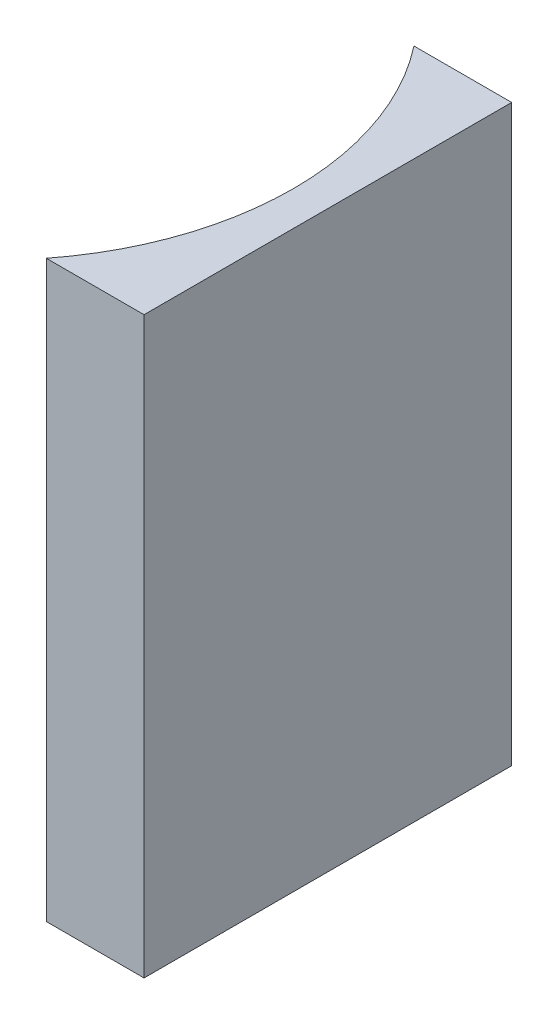
ISO-10303-21;
HEADER;
FILE_DESCRIPTION(('STEP AP214'),'2;1');
FILE_NAME('part.step','',(''),(''),'','','');
FILE_SCHEMA(('AUTOMOTIVE_DESIGN { 1 0 10303 214 1 1 1 1 }'));
ENDSEC;
DATA;
#1=APPLICATION_CONTEXT('core data for automotive mechanical design processes');
#2=APPLICATION_PROTOCOL_DEFINITION('international standard','automotive_design',2000,#1);
#3=PRODUCT_CONTEXT('',#1,'mechanical');
#4=PRODUCT('Part','Part','',(#3));
#5=PRODUCT_RELATED_PRODUCT_CATEGORY('part','',(#4));
#6=PRODUCT_DEFINITION_FORMATION('','',#4);
#7=PRODUCT_DEFINITION_CONTEXT('part definition',#1,'design');
#8=PRODUCT_DEFINITION('design','',#6,#7);
#9=PRODUCT_DEFINITION_SHAPE('','',#8);
#10=(LENGTH_UNIT() NAMED_UNIT(*) SI_UNIT(.MILLI.,.METRE.));
#11=(NAMED_UNIT(*) PLANE_ANGLE_UNIT() SI_UNIT($,.RADIAN.));
#12=(NAMED_UNIT(*) SI_UNIT($,.STERADIAN.) SOLID_ANGLE_UNIT());
#13=UNCERTAINTY_MEASURE_WITH_UNIT(LENGTH_MEASURE(1.E-05),#10,'distance_accuracy_value','');
#14=(GEOMETRIC_REPRESENTATION_CONTEXT(3) GLOBAL_UNCERTAINTY_ASSIGNED_CONTEXT((#13)) GLOBAL_UNIT_ASSIGNED_CONTEXT((#10,
#11,#12)) REPRESENTATION_CONTEXT('',''));
#15=CARTESIAN_POINT('',(0.,0.,0.));
#16=DIRECTION('',(0.,0.,1.));
#17=DIRECTION('',(1.,0.,0.));
#18=AXIS2_PLACEMENT_3D('',#15,#16,#17);
#19=CARTESIAN_POINT('',(0.,25.,0.));
#20=DIRECTION('',(0.,0.,1.));
#21=DIRECTION('',(1.,0.,0.));
#22=AXIS2_PLACEMENT_3D('',#19,#20,#21);
#23=PLANE('',#22);
#24=DIRECTION('',(-1.,0.,0.));
#25=VECTOR('',#24,1.);
#26=CARTESIAN_POINT('',(0.,0.,0.));
#27=LINE('',#26,#25);
#28=CARTESIAN_POINT('',(0.,0.,0.));
#29=VERTEX_POINT('',#28);
#30=CARTESIAN_POINT('',(-4.2530492340404,0.,0.));
#31=VERTEX_POINT('',#30);
#32=EDGE_CURVE('E100',#29,#31,#27,.T.);
#33=ORIENTED_EDGE('',*,*,#32,.T.);
#34=DIRECTION('',(0.,-1.,0.));
#35=VECTOR('',#34,1.);
#36=CARTESIAN_POINT('',(-4.2530492340404,25.,0.));
#37=LINE('',#36,#35);
#38=CARTESIAN_POINT('',(-4.2530492340404,25.,0.));
#39=VERTEX_POINT('',#38);
#40=EDGE_CURVE('E11',#39,#31,#37,.T.);
#41=ORIENTED_EDGE('',*,*,#40,.F.);
#42=DIRECTION('',(-1.,0.,0.));
#43=VECTOR('',#42,1.);
#44=CARTESIAN_POINT('',(0.,25.,0.));
#45=LINE('',#44,#43);
#46=CARTESIAN_POINT('',(0.,25.,0.));
#47=VERTEX_POINT('',#46);
#48=EDGE_CURVE('E88',#47,#39,#45,.T.);
#49=ORIENTED_EDGE('',*,*,#48,.F.);
#50=DIRECTION('',(0.,-1.,0.));
#51=VECTOR('',#50,1.);
#52=CARTESIAN_POINT('',(0.,25.,0.));
#53=LINE('',#52,#51);
#54=EDGE_CURVE('E96',#47,#29,#53,.T.);
#55=ORIENTED_EDGE('',*,*,#54,.T.);
#56=EDGE_LOOP('',(#33,#41,#49,#55));
#57=FACE_BOUND('',#56,.T.);
#58=ADVANCED_FACE('F37',(#57),#23,.F.);
#59=CARTESIAN_POINT('',(-14.5,25.,8.));
#60=DIRECTION('',(0.,-1.,0.));
#61=DIRECTION('',(0.,0.,-1.));
#62=AXIS2_PLACEMENT_3D('',#59,#60,#61);
#63=CYLINDRICAL_SURFACE('',#62,13.);
#64=CARTESIAN_POINT('',(-14.5,0.,8.));
#65=DIRECTION('',(0.,-1.,0.));
#66=DIRECTION('',(0.,0.,1.));
#67=AXIS2_PLACEMENT_3D('',#64,#65,#66);
#68=CIRCLE('',#67,13.);
#69=CARTESIAN_POINT('',(-4.2530492340404,0.,16.));
#70=VERTEX_POINT('',#69);
#71=EDGE_CURVE('E92',#31,#70,#68,.T.);
#72=ORIENTED_EDGE('',*,*,#71,.T.);
#73=DIRECTION('',(0.,-1.,0.));
#74=VECTOR('',#73,1.);
#75=CARTESIAN_POINT('',(-4.2530492340404,25.,16.));
#76=LINE('',#75,#74);
#77=CARTESIAN_POINT('',(-4.2530492340404,25.,16.));
#78=VERTEX_POINT('',#77);
#79=EDGE_CURVE('E45',#78,#70,#76,.T.);
#80=ORIENTED_EDGE('',*,*,#79,.F.);
#81=CARTESIAN_POINT('',(-14.5,25.,8.));
#82=DIRECTION('',(0.,-1.,0.));
#83=DIRECTION('',(0.,0.,1.));
#84=AXIS2_PLACEMENT_3D('',#81,#82,#83);
#85=CIRCLE('',#84,13.);
#86=EDGE_CURVE('E83',#39,#78,#85,.T.);
#87=ORIENTED_EDGE('',*,*,#86,.F.);
#88=ORIENTED_EDGE('',*,*,#40,.T.);
#89=EDGE_LOOP('',(#72,#80,#87,#88));
#90=FACE_BOUND('',#89,.T.);
#91=ADVANCED_FACE('F91',(#90),#63,.F.);
#92=CARTESIAN_POINT('',(0.,25.,16.));
#93=DIRECTION('',(0.,0.,-1.));
#94=DIRECTION('',(-1.,0.,0.));
#95=AXIS2_PLACEMENT_3D('',#92,#93,#94);
#96=PLANE('',#95);
#97=DIRECTION('',(1.,0.,0.));
#98=VECTOR('',#97,1.);
#99=CARTESIAN_POINT('',(0.,0.,16.));
#100=LINE('',#99,#98);
#101=CARTESIAN_POINT('',(0.,0.,16.));
#102=VERTEX_POINT('',#101);
#103=EDGE_CURVE('E70',#70,#102,#100,.T.);
#104=ORIENTED_EDGE('',*,*,#103,.T.);
#105=DIRECTION('',(0.,-1.,0.));
#106=VECTOR('',#105,1.);
#107=CARTESIAN_POINT('',(0.,25.,16.));
#108=LINE('',#107,#106);
#109=CARTESIAN_POINT('',(0.,25.,16.));
#110=VERTEX_POINT('',#109);
#111=EDGE_CURVE('E93',#110,#102,#108,.T.);
#112=ORIENTED_EDGE('',*,*,#111,.F.);
#113=DIRECTION('',(1.,0.,0.));
#114=VECTOR('',#113,1.);
#115=CARTESIAN_POINT('',(0.,25.,16.));
#116=LINE('',#115,#114);
#117=EDGE_CURVE('E86',#78,#110,#116,.T.);
#118=ORIENTED_EDGE('',*,*,#117,.F.);
#119=ORIENTED_EDGE('',*,*,#79,.T.);
#120=EDGE_LOOP('',(#104,#112,#118,#119));
#121=FACE_BOUND('',#120,.T.);
#122=ADVANCED_FACE('F94',(#121),#96,.F.);
#123=CARTESIAN_POINT('',(0.,25.,0.));
#124=DIRECTION('',(-1.,0.,0.));
#125=DIRECTION('',(0.,0.,1.));
#126=AXIS2_PLACEMENT_3D('',#123,#124,#125);
#127=PLANE('',#126);
#128=DIRECTION('',(0.,0.,-1.));
#129=VECTOR('',#128,1.);
#130=CARTESIAN_POINT('',(0.,0.,0.));
#131=LINE('',#130,#129);
#132=EDGE_CURVE('E76',#102,#29,#131,.T.);
#133=ORIENTED_EDGE('',*,*,#132,.T.);
#134=ORIENTED_EDGE('',*,*,#54,.F.);
#135=DIRECTION('',(0.,0.,-1.));
#136=VECTOR('',#135,1.);
#137=CARTESIAN_POINT('',(0.,25.,0.));
#138=LINE('',#137,#136);
#139=EDGE_CURVE('E53',#110,#47,#138,.T.);
#140=ORIENTED_EDGE('',*,*,#139,.F.);
#141=ORIENTED_EDGE('',*,*,#111,.T.);
#142=EDGE_LOOP('',(#133,#134,#140,#141));
#143=FACE_BOUND('',#142,.T.);
#144=ADVANCED_FACE('F107',(#143),#127,.F.);
#145=CARTESIAN_POINT('',(-14.5,25.,8.));
#146=DIRECTION('',(0.,1.,0.));
#147=DIRECTION('',(0.,0.,1.));
#148=AXIS2_PLACEMENT_3D('',#145,#146,#147);
#149=PLANE('',#148);
#150=ORIENTED_EDGE('',*,*,#48,.T.);
#151=ORIENTED_EDGE('',*,*,#86,.T.);
#152=ORIENTED_EDGE('',*,*,#117,.T.);
#153=ORIENTED_EDGE('',*,*,#139,.T.);
#154=EDGE_LOOP('',(#150,#151,#152,#153));
#155=FACE_BOUND('',#154,.T.);
#156=ADVANCED_FACE('F84',(#155),#149,.T.);
#157=CARTESIAN_POINT('',(-14.5,0.,8.));
#158=DIRECTION('',(0.,1.,0.));
#159=DIRECTION('',(0.,0.,1.));
#160=AXIS2_PLACEMENT_3D('',#157,#158,#159);
#161=PLANE('',#160);
#162=ORIENTED_EDGE('',*,*,#32,.F.);
#163=ORIENTED_EDGE('',*,*,#132,.F.);
#164=ORIENTED_EDGE('',*,*,#103,.F.);
#165=ORIENTED_EDGE('',*,*,#71,.F.);
#166=EDGE_LOOP('',(#162,#163,#164,#165));
#167=FACE_BOUND('',#166,.T.);
#168=ADVANCED_FACE('F110',(#167),#161,.F.);
#169=CLOSED_SHELL('',(#58,#91,#122,#144,#156,#168));
#170=MANIFOLD_SOLID_BREP('B2',#169);
#171=ADVANCED_BREP_SHAPE_REPRESENTATION('',(#18,#170),#14);
#172=SHAPE_DEFINITION_REPRESENTATION(#9,#171);
ENDSEC;
END-ISO-10303-21;
